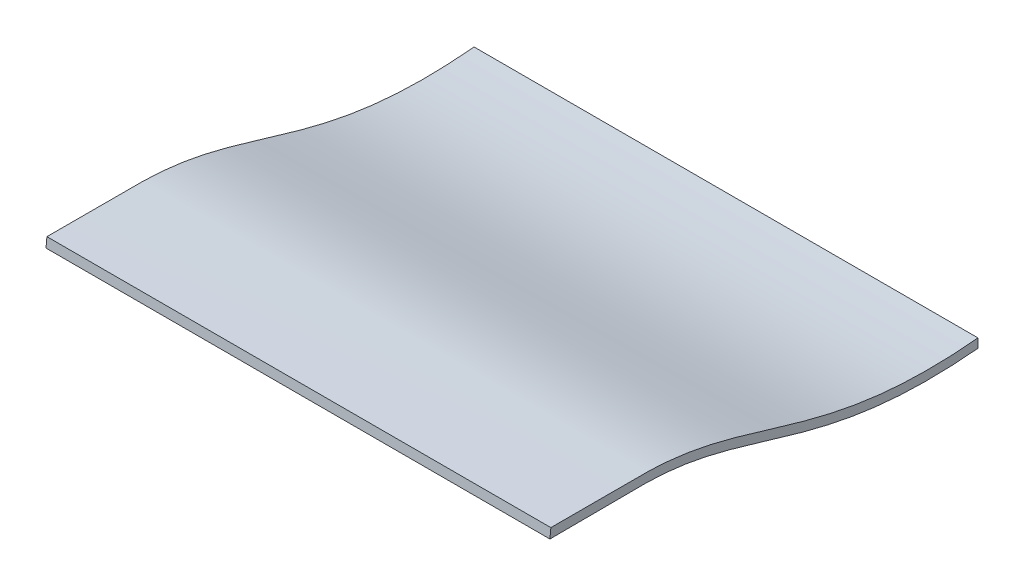
ISO-10303-21;
HEADER;
FILE_DESCRIPTION(('STEP AP214'),'2;1');
FILE_NAME('part.step','',(''),(''),'','','');
FILE_SCHEMA(('AUTOMOTIVE_DESIGN { 1 0 10303 214 1 1 1 1 }'));
ENDSEC;
DATA;
#1=APPLICATION_CONTEXT('core data for automotive mechanical design processes');
#2=APPLICATION_PROTOCOL_DEFINITION('international standard','automotive_design',2000,#1);
#3=PRODUCT_CONTEXT('',#1,'mechanical');
#4=PRODUCT('Part','Part','',(#3));
#5=PRODUCT_RELATED_PRODUCT_CATEGORY('part','',(#4));
#6=PRODUCT_DEFINITION_FORMATION('','',#4);
#7=PRODUCT_DEFINITION_CONTEXT('part definition',#1,'design');
#8=PRODUCT_DEFINITION('design','',#6,#7);
#9=PRODUCT_DEFINITION_SHAPE('','',#8);
#10=(LENGTH_UNIT() NAMED_UNIT(*) SI_UNIT(.MILLI.,.METRE.));
#11=(NAMED_UNIT(*) PLANE_ANGLE_UNIT() SI_UNIT($,.RADIAN.));
#12=(NAMED_UNIT(*) SI_UNIT($,.STERADIAN.) SOLID_ANGLE_UNIT());
#13=UNCERTAINTY_MEASURE_WITH_UNIT(LENGTH_MEASURE(1.E-05),#10,'distance_accuracy_value','');
#14=(GEOMETRIC_REPRESENTATION_CONTEXT(3) GLOBAL_UNCERTAINTY_ASSIGNED_CONTEXT((#13)) GLOBAL_UNIT_ASSIGNED_CONTEXT((#10,
#11,#12)) REPRESENTATION_CONTEXT('',''));
#15=CARTESIAN_POINT('',(0.,0.,0.));
#16=DIRECTION('',(0.,0.,1.));
#17=DIRECTION('',(1.,0.,0.));
#18=AXIS2_PLACEMENT_3D('',#15,#16,#17);
#19=CARTESIAN_POINT('',(2.8672,0.,4.));
#20=CARTESIAN_POINT('',(-3.92,0.,4.));
#21=CARTESIAN_POINT('',(2.8672,-0.024628468,4.256388466));
#22=CARTESIAN_POINT('',(-3.92,-0.024628468,4.256388466));
#23=CARTESIAN_POINT('',(2.8672,-0.038618016,4.72259081));
#24=CARTESIAN_POINT('',(-3.92,-0.038618016,4.72259081));
#25=CARTESIAN_POINT('',(2.8672,0.01947153,5.312011185));
#26=CARTESIAN_POINT('',(-3.92,0.01947153,5.312011185));
#27=CARTESIAN_POINT('',(2.8672,0.129906645,5.821389043));
#28=CARTESIAN_POINT('',(-3.92,0.129906645,5.821389043));
#29=CARTESIAN_POINT('',(2.8672,0.291873769,6.368027096));
#30=CARTESIAN_POINT('',(-3.92,0.291873769,6.368027096));
#31=CARTESIAN_POINT('',(2.8672,0.477782991,6.965975593));
#32=CARTESIAN_POINT('',(-3.92,0.477782991,6.965975593));
#33=CARTESIAN_POINT('',(2.8672,0.547843022,7.463268805));
#34=CARTESIAN_POINT('',(-3.92,0.547843022,7.463268805));
#35=CARTESIAN_POINT('',(2.8672,0.547843022,7.742133946));
#36=CARTESIAN_POINT('',(-3.92,0.547843022,7.742133946));
#37=CARTESIAN_POINT('',(2.8672,0.547843022,8.57930318693468));
#38=CARTESIAN_POINT('',(-3.92,0.547843022,8.57930318693468));
#39=CARTESIAN_POINT('',(2.8672,0.547843022,9.41647242786936));
#40=CARTESIAN_POINT('',(-3.92,0.547843022,9.41647242786936));
#41=CARTESIAN_POINT('',(2.8672,0.547843022,10.253641668804));
#42=CARTESIAN_POINT('',(-3.92,0.547843022,10.253641668804));
#43=B_SPLINE_SURFACE_WITH_KNOTS('',3,1,((#19,#20),(#21,#22),(#23,#24),(#25,#26),(#27,#28),(#29,
#30),(#31,#32),(#33,#34),(#35,#36),(#37,#38),(#39,#40),(#41,#42)),.UNSPECIFIED.,.F.,.F.,.F.,(4,
1,1,1,1,1,3,4),(2,2),(0.,0.14,0.28,0.42,0.559999999997895,0.780000000000162,1.,
1.66045269173853),(-0.00672,0.672),.UNSPECIFIED.);
#44=CARTESIAN_POINT('',(-2.8,0.547843022,8.74673703512159));
#45=CARTESIAN_POINT('',(-2.8,0.547842906702326,8.68528571674755));
#46=CARTESIAN_POINT('',(-2.8,0.547842964198973,8.62383439827284));
#47=CARTESIAN_POINT('',(-2.8,0.547843080107016,8.50060644710681));
#48=CARTESIAN_POINT('',(-2.8,0.547843138521643,8.43882981441547));
#49=CARTESIAN_POINT('',(-2.8,0.547842905081755,8.31506628140649));
#50=CARTESIAN_POINT('',(-2.8,0.54784261203436,8.25307938108954));
#51=CARTESIAN_POINT('',(-2.8,0.54784343259541,8.12901035819153));
#52=CARTESIAN_POINT('',(-2.8,0.547844548365387,8.06692823560921));
#53=CARTESIAN_POINT('',(-2.8,0.54784228226672,7.97475881607305));
#54=CARTESIAN_POINT('',(-2.8,0.547840921966892,7.94467151794153));
#55=CARTESIAN_POINT('',(-2.8,0.547845122145863,7.88449530220247));
#56=CARTESIAN_POINT('',(-2.8,0.547850682996255,7.85440638459473));
#57=CARTESIAN_POINT('',(-2.8,0.547839196398691,7.80929225221311));
#58=CARTESIAN_POINT('',(-2.8,0.547832073781566,7.79426703165736));
#59=CARTESIAN_POINT('',(-2.8,0.547853970254236,7.76421652035728));
#60=CARTESIAN_POINT('',(-2.8,0.547882989462217,7.74919122961287));
#61=CARTESIAN_POINT('',(-2.8,0.547783984428342,7.71914228667047));
#62=CARTESIAN_POINT('',(-2.8,0.547655976451005,7.70411863446392));
#63=CARTESIAN_POINT('',(-2.8,0.547182678089916,7.67407502080611));
#64=CARTESIAN_POINT('',(-2.8,0.546837390533576,7.65905505930935));
#65=CARTESIAN_POINT('',(-2.8,0.545498104294444,7.61408616045096));
#66=CARTESIAN_POINT('',(-2.8,0.544200462391214,7.58414561436942));
#67=CARTESIAN_POINT('',(-2.8,0.540781918126866,7.5243089237964));
#68=CARTESIAN_POINT('',(-2.8,0.538660916387852,7.49441278510221));
#69=CARTESIAN_POINT('',(-2.8,0.531084497477442,7.40491049720686));
#70=CARTESIAN_POINT('',(-2.8,0.524413060488041,7.3454037577374));
#71=CARTESIAN_POINT('',(-2.8,0.505054373277433,7.20553805547719));
#72=CARTESIAN_POINT('',(-2.8,0.49106741739192,7.12535976173874));
#73=CARTESIAN_POINT('',(-2.8,0.458348257888318,6.96576026035285));
#74=CARTESIAN_POINT('',(-2.8,0.439602277869368,6.88634195742287));
#75=CARTESIAN_POINT('',(-2.8,0.398804162548757,6.72826779878592));
#76=CARTESIAN_POINT('',(-2.8,0.376747614363769,6.6496131122451));
#77=CARTESIAN_POINT('',(-2.8,0.330896653138866,6.49237475511494));
#78=CARTESIAN_POINT('',(-2.8,0.307093689085984,6.41379364626243));
#79=CARTESIAN_POINT('',(-2.8,0.259573871282777,6.25673118750272));
#80=CARTESIAN_POINT('',(-2.8,0.235856942343488,6.17824986110475));
#81=CARTESIAN_POINT('',(-2.8,0.189972865135392,6.02085254458342));
#82=CARTESIAN_POINT('',(-2.8,0.167805232549242,5.94193669869016));
#83=CARTESIAN_POINT('',(-2.8,0.126099769165425,5.78297462889497));
#84=CARTESIAN_POINT('',(-2.8,0.106575783383594,5.70292470923044));
#85=CARTESIAN_POINT('',(-2.8,0.0711327721986367,5.54198267820483));
#86=CARTESIAN_POINT('',(-2.8,0.0552153901064553,5.46109020042868));
#87=CARTESIAN_POINT('',(-2.8,0.0274831509551212,5.29860395630055));
#88=CARTESIAN_POINT('',(-2.8,0.0156681085146804,5.21701022180858));
#89=CARTESIAN_POINT('',(-2.8,-0.00365394145678587,5.05365115991832));
#90=CARTESIAN_POINT('',(-2.8,-0.0111783002128884,4.97188788512288));
#91=CARTESIAN_POINT('',(-2.8,-0.0220647987660413,4.80807822579403));
#92=CARTESIAN_POINT('',(-2.8,-0.0254264454305133,4.72603180887268));
#93=CARTESIAN_POINT('',(-2.8,-0.0282081796048502,4.56189899319011));
#94=CARTESIAN_POINT('',(-2.8,-0.0276293976794587,4.47981261265323));
#95=CARTESIAN_POINT('',(-2.8,-0.0232940887268819,4.33140886200852));
#96=CARTESIAN_POINT('',(-2.8,-0.0201650529801226,4.26507158041845));
#97=CARTESIAN_POINT('',(-2.8,-0.0116978988822259,4.13245532577286));
#98=CARTESIAN_POINT('',(-2.8,-0.00635707039965284,4.06617652456653));
#99=CARTESIAN_POINT('',(-2.8,0.,4.));
#100=B_SPLINE_CURVE_WITH_KNOTS('',3,(#44,#45,#46,#47,#48,#49,#50,#51,#52,#53,#54,#55,#56,#57,
#58,#59,#60,#61,#62,#63,#64,#65,#66,#67,#68,#69,#70,#71,#72,#73,#74,#75,#76,#77,#78,#79,#80,#81,
#82,#83,#84,#85,#86,#87,#88,#89,#90,#91,#92,#93,#94,#95,#96,#97,#98,#99),.UNSPECIFIED.,.F.,.F.,
(4,2,2,2,2,2,2,2,2,2,2,2,2,2,2,2,2,2,2,2,2,2,2,2,2,2,2,4),(0.,0.184353955323629,
0.369683853295539,0.555644554758549,0.741890920555486,0.832152817327458,0.922419560432007,
0.967495234547427,1.01257105606386,1.05764220912332,1.10271277569349,1.19260620618809,
1.28251049001648,1.46205914291478,1.70604383123385,1.95074302330179,2.19577133701712,
2.44209177025096,2.68804945864641,2.93392991238468,3.18105199234312,3.42828644545333,
3.67550972479147,3.92172602834634,4.16797149694215,4.4141463172052,4.61334321924149,
4.81278492478183),.UNSPECIFIED.);
#101=CARTESIAN_POINT('',(-2.8,0.547843022,8.7467370351216));
#102=VERTEX_POINT('',#101);
#103=CARTESIAN_POINT('',(-2.8,0.,4.));
#104=VERTEX_POINT('',#103);
#105=EDGE_CURVE('E23',#102,#104,#100,.T.);
#106=DIRECTION('',(1.,0.,0.));
#107=VECTOR('',#106,1.);
#108=CARTESIAN_POINT('',(0.,0.547843022,8.74673703512162));
#109=LINE('',#108,#107);
#110=CARTESIAN_POINT('',(2.8,0.547843022,8.7467370351216));
#111=VERTEX_POINT('',#110);
#112=EDGE_CURVE('E65',#111,#102,#109,.F.);
#113=CARTESIAN_POINT('',(2.8,0.,4.));
#114=CARTESIAN_POINT('',(2.8,-0.00884743046204992,4.09205858219701));
#115=CARTESIAN_POINT('',(2.8,-0.0157227959919003,4.18433034520398));
#116=CARTESIAN_POINT('',(2.8,-0.0250705776314633,4.36921030327923));
#117=CARTESIAN_POINT('',(2.8,-0.0275374015249569,4.46181877654538));
#118=CARTESIAN_POINT('',(2.8,-0.0275844910846493,4.64707318642334));
#119=CARTESIAN_POINT('',(2.8,-0.0251634165216857,4.73971912634436));
#120=CARTESIAN_POINT('',(2.8,-0.0151702693742893,4.92285018551999));
#121=CARTESIAN_POINT('',(2.8,-0.00770377228910637,5.01334098714492));
#122=CARTESIAN_POINT('',(2.8,0.0124057404538056,5.19368091528302));
#123=CARTESIAN_POINT('',(2.8,0.0250450581813154,5.28353045363163));
#124=CARTESIAN_POINT('',(2.8,0.055295524818302,5.46228799230291));
#125=CARTESIAN_POINT('',(2.8,0.0729015629968635,5.55119686350463));
#126=CARTESIAN_POINT('',(2.8,0.106902452484785,5.70333505026525));
#127=CARTESIAN_POINT('',(2.8,0.122261992695236,5.76680053179104));
#128=CARTESIAN_POINT('',(2.8,0.154795780809255,5.89326590331332));
#129=CARTESIAN_POINT('',(2.8,0.17197015648176,5.95626576019416));
#130=CARTESIAN_POINT('',(2.8,0.207609416509552,6.0820341866934));
#131=CARTESIAN_POINT('',(2.8,0.226076861143274,6.14480202266021));
#132=CARTESIAN_POINT('',(2.8,0.263576065434319,6.2701696677427));
#133=CARTESIAN_POINT('',(2.8,0.282607881064201,6.33276945951636));
#134=CARTESIAN_POINT('',(2.8,0.339342837832746,6.52067130538712));
#135=CARTESIAN_POINT('',(2.8,0.376693554934573,6.64610182510756));
#136=CARTESIAN_POINT('',(2.8,0.426789565151415,6.83559559014639));
#137=CARTESIAN_POINT('',(2.8,0.44247493218745,6.89885962548878));
#138=CARTESIAN_POINT('',(2.8,0.471129988229087,7.02599107732407));
#139=CARTESIAN_POINT('',(2.8,0.484100341283253,7.08985834227338));
#140=CARTESIAN_POINT('',(2.8,0.506767336079929,7.21851795518392));
#141=CARTESIAN_POINT('',(2.8,0.516447085169036,7.28331334847186));
#142=CARTESIAN_POINT('',(2.8,0.528146294018996,7.38088824719804));
#143=CARTESIAN_POINT('',(2.8,0.531577558503533,7.41350283404392));
#144=CARTESIAN_POINT('',(2.8,0.537472390646986,7.47881643158059));
#145=CARTESIAN_POINT('',(2.8,0.539936073128194,7.51151543179027));
#146=CARTESIAN_POINT('',(2.8,0.543880754246365,7.57707670126507));
#147=CARTESIAN_POINT('',(2.8,0.545358615569614,7.60993915961647));
#148=CARTESIAN_POINT('',(2.8,0.54685117899047,7.6592557233188));
#149=CARTESIAN_POINT('',(2.8,0.547227996356305,7.67569950172081));
#150=CARTESIAN_POINT('',(2.8,0.547705404736432,7.70859144176619));
#151=CARTESIAN_POINT('',(2.8,0.547805987776157,7.72503960352237));
#152=CARTESIAN_POINT('',(2.8,0.547880023412574,7.75797686300814));
#153=CARTESIAN_POINT('',(2.8,0.547853156827478,7.77446596004081));
#154=CARTESIAN_POINT('',(2.8,0.547832887290195,7.80744403579182));
#155=CARTESIAN_POINT('',(2.8,0.547839483949478,7.82393301450929));
#156=CARTESIAN_POINT('',(2.8,0.547850097794964,7.87339850412885));
#157=CARTESIAN_POINT('',(2.8,0.547844940213279,7.90637499497928));
#158=CARTESIAN_POINT('',(2.8,0.547841054617476,7.97317327197277));
#159=CARTESIAN_POINT('',(2.8,0.547842494800152,8.00699505848345));
#160=CARTESIAN_POINT('',(2.8,0.547843549206849,8.07463907667339));
#161=CARTESIAN_POINT('',(2.8,0.547843163406621,8.1084613083526));
#162=CARTESIAN_POINT('',(2.8,0.547842880860223,8.17604194794232));
#163=CARTESIAN_POINT('',(2.8,0.54784298319255,8.20980035585081));
#164=CARTESIAN_POINT('',(2.8,0.547843060807309,8.27731704928939));
#165=CARTESIAN_POINT('',(2.8,0.547843036090201,8.31107533481947));
#166=CARTESIAN_POINT('',(2.8,0.547842993944022,8.41205208752087));
#167=CARTESIAN_POINT('',(2.8,0.547843008021134,8.47927055476103));
#168=CARTESIAN_POINT('',(2.8,0.547843035881305,8.61323835973819));
#169=CARTESIAN_POINT('',(2.8,0.54784304966573,8.67998769747519));
#170=CARTESIAN_POINT('',(2.8,0.547843022,8.74673703512159));
#171=B_SPLINE_CURVE_WITH_KNOTS('',3,(#113,#114,#115,#116,#117,#118,#119,#120,#121,#122,#123,
#124,#125,#126,#127,#128,#129,#130,#131,#132,#133,#134,#135,#136,#137,#138,#139,#140,#141,#142,
#143,#144,#145,#146,#147,#148,#149,#150,#151,#152,#153,#154,#155,#156,#157,#158,#159,#160,#161,
#162,#163,#164,#165,#166,#167,#168,#169,#170),.UNSPECIFIED.,.F.,.F.,(4,2,2,2,2,2,2,2,2,2,2,2,2,
2,2,2,2,2,2,2,2,2,2,2,2,2,2,2,4),(0.,0.277462266606104,0.5552762437618,0.833166406002992,
1.10541473416526,1.37746877728997,1.64924389290612,1.84510669939396,2.04098330430982,
2.23725935523744,2.43355493774901,2.82606442173887,3.02155488316188,3.21699747476353,
3.41342875254236,3.51180035622406,3.61016028268545,3.70883175873313,3.7581741608985,
3.80751798750718,3.85698545475782,3.9064523476588,4.0053818540261,4.10684720411547,
4.20831390168262,4.30958912473716,4.41086398148947,4.61251938311767,4.81276739623828),.UNSPECIFIED.);
#172=CARTESIAN_POINT('',(2.8,0.,4.));
#173=VERTEX_POINT('',#172);
#174=EDGE_CURVE('E78',#173,#111,#171,.T.);
#175=DIRECTION('',(1.,0.,0.));
#176=VECTOR('',#175,1.);
#177=CARTESIAN_POINT('',(0.,0.,4.));
#178=LINE('',#177,#176);
#179=EDGE_CURVE('E67',#173,#104,#178,.F.);
#180=ORIENTED_EDGE('',*,*,#105,.F.);
#181=ORIENTED_EDGE('',*,*,#112,.F.);
#182=ORIENTED_EDGE('',*,*,#174,.F.);
#183=ORIENTED_EDGE('',*,*,#179,.T.);
#184=EDGE_LOOP('',(#180,#181,#182,#183));
#185=FACE_BOUND('',#184,.T.);
#186=ADVANCED_FACE('F16',(#185),#43,.F.);
#187=CARTESIAN_POINT('',(-2.8,0.192627967,4.));
#188=DIRECTION('',(-1.,0.,0.));
#189=DIRECTION('',(0.,0.,1.));
#190=AXIS2_PLACEMENT_3D('',#187,#188,#189);
#191=PLANE('',#190);
#192=DIRECTION('',(0.,-0.995418002222509,0.095619040213487));
#193=VECTOR('',#192,1.);
#194=CARTESIAN_POINT('',(-2.8,0.543920262213487,8.74711385222251));
#195=LINE('',#194,#193);
#196=CARTESIAN_POINT('',(-2.8,0.442668977260629,8.75683996795073));
#197=VERTEX_POINT('',#196);
#198=EDGE_CURVE('E72',#102,#197,#195,.T.);
#199=ORIENTED_EDGE('',*,*,#198,.F.);
#200=ORIENTED_EDGE('',*,*,#105,.T.);
#201=DIRECTION('',(0.,1.,0.));
#202=VECTOR('',#201,1.);
#203=CARTESIAN_POINT('',(-2.8,-0.1,4.));
#204=LINE('',#203,#202);
#205=CARTESIAN_POINT('',(-2.8,-0.1,4.));
#206=VERTEX_POINT('',#205);
#207=EDGE_CURVE('E86',#104,#206,#204,.F.);
#208=ORIENTED_EDGE('',*,*,#207,.T.);
#209=CARTESIAN_POINT('',(-2.8,-0.1,4.));
#210=CARTESIAN_POINT('',(-2.8,-0.108905872787101,4.09474520944262));
#211=CARTESIAN_POINT('',(-2.8,-0.115789153962948,4.1897074515527));
#212=CARTESIAN_POINT('',(-2.8,-0.124989931256523,4.37995403207937));
#213=CARTESIAN_POINT('',(-2.8,-0.127302369388049,4.47523861056854));
#214=CARTESIAN_POINT('',(-2.8,-0.126818780818783,4.66582542472838));
#215=CARTESIAN_POINT('',(-2.8,-0.12402178582099,4.7611276603228));
#216=CARTESIAN_POINT('',(-2.8,-0.113048144902698,4.94950631638367));
#217=CARTESIAN_POINT('',(-2.8,-0.104980517394534,5.04258904340113));
#218=CARTESIAN_POINT('',(-2.8,-0.0834777878587851,5.22807357373039));
#219=CARTESIAN_POINT('',(-2.8,-0.0700463112012425,5.32047579411537));
#220=CARTESIAN_POINT('',(-2.8,-0.0460659967579736,5.45835332332887));
#221=CARTESIAN_POINT('',(-2.8,-0.0374381554607821,5.5041723570409));
#222=CARTESIAN_POINT('',(-2.8,-0.0189857232088821,5.59556286418674));
#223=CARTESIAN_POINT('',(-2.8,-0.00916129651699088,5.64113437070498));
#224=CARTESIAN_POINT('',(-2.8,0.0155671182570966,5.74947932695414));
#225=CARTESIAN_POINT('',(-2.8,0.0309729127038378,5.81213799274748));
#226=CARTESIAN_POINT('',(-2.8,0.0634872313896632,5.93701426318799));
#227=CARTESIAN_POINT('',(-2.8,0.0805959248745248,5.99923182333544));
#228=CARTESIAN_POINT('',(-2.8,0.133701177283009,6.18543382773715));
#229=CARTESIAN_POINT('',(-2.8,0.171461549029286,6.30890481440444));
#230=CARTESIAN_POINT('',(-2.8,0.227310585281221,6.49434791357856));
#231=CARTESIAN_POINT('',(-2.8,0.245796046913832,6.55620526739254));
#232=CARTESIAN_POINT('',(-2.8,0.281686067422485,6.68022985177974));
#233=CARTESIAN_POINT('',(-2.8,0.299090780495993,6.74239703677372));
#234=CARTESIAN_POINT('',(-2.8,0.331921619369486,6.86699277584998));
#235=CARTESIAN_POINT('',(-2.8,0.347355388066259,6.929419286883));
#236=CARTESIAN_POINT('',(-2.8,0.375539412252017,7.05487328306878));
#237=CARTESIAN_POINT('',(-2.8,0.388290363935862,7.11790060786076));
#238=CARTESIAN_POINT('',(-2.8,0.404923055608675,7.21310745048152));
#239=CARTESIAN_POINT('',(-2.8,0.410065411026173,7.24506855513573));
#240=CARTESIAN_POINT('',(-2.8,0.419429875752844,7.30912827829778));
#241=CARTESIAN_POINT('',(-2.8,0.423651930908881,7.34122690478454));
#242=CARTESIAN_POINT('',(-2.8,0.431130256220014,7.40558404973198));
#243=CARTESIAN_POINT('',(-2.8,0.434385107610895,7.43784273319446));
#244=CARTESIAN_POINT('',(-2.8,0.439889206173268,7.50244171907489));
#245=CARTESIAN_POINT('',(-2.8,0.442138605108399,7.5347820084336));
#246=CARTESIAN_POINT('',(-2.8,0.444751922462403,7.58338740533369));
#247=CARTESIAN_POINT('',(-2.8,0.445496849948542,7.59963287809563));
#248=CARTESIAN_POINT('',(-2.8,0.446730992637988,7.6321329865827));
#249=CARTESIAN_POINT('',(-2.8,0.447220218773499,7.64838762188634));
#250=CARTESIAN_POINT('',(-2.8,0.447941961489845,7.68090518168157));
#251=CARTESIAN_POINT('',(-2.8,0.448174436850442,7.69716810708491));
#252=CARTESIAN_POINT('',(-2.8,0.448337242978448,7.7215639524491));
#253=CARTESIAN_POINT('',(-2.8,0.448360525648154,7.72969632518401));
#254=CARTESIAN_POINT('',(-2.8,0.448336315686042,7.74596101646417));
#255=CARTESIAN_POINT('',(-2.8,0.448288822166695,7.75409333500745));
#256=CARTESIAN_POINT('',(-2.8,0.448148783420142,7.77853033934389));
#257=CARTESIAN_POINT('',(-2.8,0.448058927320061,7.79483498451979));
#258=CARTESIAN_POINT('',(-2.8,0.447877341397791,7.82744397730012));
#259=CARTESIAN_POINT('',(-2.8,0.44778561161309,7.84374832490398));
#260=CARTESIAN_POINT('',(-2.8,0.447510947642803,7.89265936329145));
#261=CARTESIAN_POINT('',(-2.8,0.447328527544684,7.92526604631015));
#262=CARTESIAN_POINT('',(-2.8,0.446958450186208,7.99134991848952));
#263=CARTESIAN_POINT('',(-2.8,0.446770783125569,8.02482710779822));
#264=CARTESIAN_POINT('',(-2.8,0.44639554540241,8.09178213059635));
#265=CARTESIAN_POINT('',(-2.8,0.44620797474182,8.12525996408576));
#266=CARTESIAN_POINT('',(-2.8,0.445645979505342,8.2255606697448));
#267=CARTESIAN_POINT('',(-2.8,0.445271527753725,8.29238354232488));
#268=CARTESIAN_POINT('',(-2.8,0.444524370254195,8.42572094308319));
#269=CARTESIAN_POINT('',(-2.8,0.444151664422522,8.49223547126267));
#270=CARTESIAN_POINT('',(-2.8,0.443408967767523,8.6247799889004));
#271=CARTESIAN_POINT('',(-2.8,0.443038976944517,8.69080997835864));
#272=CARTESIAN_POINT('',(-2.8,0.442668977260629,8.75683996795071));
#273=B_SPLINE_CURVE_WITH_KNOTS('',3,(#209,#210,#211,#212,#213,#214,#215,#216,#217,#218,#219,
#220,#221,#222,#223,#224,#225,#226,#227,#228,#229,#230,#231,#232,#233,#234,#235,#236,#237,#238,
#239,#240,#241,#242,#243,#244,#245,#246,#247,#248,#249,#250,#251,#252,#253,#254,#255,#256,#257,
#258,#259,#260,#261,#262,#263,#264,#265,#266,#267,#268,#269,#270,#271,#272),.UNSPECIFIED.,.F.,
.F.,(4,2,2,2,2,2,2,2,2,2,2,2,2,2,2,2,2,2,2,2,2,2,2,2,2,2,2,2,2,2,2,4),(0.,0.285506980144167,
0.571329719045214,0.85720663029884,1.13735004307945,1.41730442942976,1.55716367382693,
1.69700374045805,1.89054662021298,2.08410875482945,2.47142674369267,2.66510793330223,
2.85876142535276,3.05163956399039,3.24446758857313,3.34157265237801,3.43868342858493,
3.53593595856488,3.63317380422444,3.68195977354655,3.73074365691247,3.77953537118399,
3.80393231666072,3.82832956807602,3.87724433973849,3.92615813368494,4.02397973151109,
4.12441287247664,4.22484795054686,4.42531971476556,4.62486643208221,4.82295951041181),.UNSPECIFIED.);
#274=EDGE_CURVE('E82',#206,#197,#273,.T.);
#275=ORIENTED_EDGE('',*,*,#274,.T.);
#276=EDGE_LOOP('',(#199,#200,#208,#275));
#277=FACE_BOUND('',#276,.T.);
#278=ADVANCED_FACE('F81',(#277),#191,.T.);
#279=CARTESIAN_POINT('',(0.,0.543920262213487,8.74711385222251));
#280=DIRECTION('',(0.,0.095619040213487,0.995418002222509));
#281=DIRECTION('',(0.,-0.995418002222509,0.095619040213487));
#282=AXIS2_PLACEMENT_3D('',#279,#280,#281);
#283=PLANE('',#282);
#284=DIRECTION('',(0.,-0.995418002222516,0.0956190402134144));
#285=VECTOR('',#284,1.);
#286=CARTESIAN_POINT('',(2.8,0.547843022,8.74673703512162));
#287=LINE('',#286,#285);
#288=CARTESIAN_POINT('',(2.8,0.442668977260628,8.75683996795072));
#289=VERTEX_POINT('',#288);
#290=EDGE_CURVE('E77',#111,#289,#287,.T.);
#291=ORIENTED_EDGE('',*,*,#290,.F.);
#292=ORIENTED_EDGE('',*,*,#112,.T.);
#293=ORIENTED_EDGE('',*,*,#198,.T.);
#294=DIRECTION('',(1.,0.,0.));
#295=VECTOR('',#294,1.);
#296=CARTESIAN_POINT('',(0.5264,0.442668977260628,8.75683996795073));
#297=LINE('',#296,#295);
#298=EDGE_CURVE('E96',#197,#289,#297,.T.);
#299=ORIENTED_EDGE('',*,*,#298,.T.);
#300=EDGE_LOOP('',(#291,#292,#293,#299));
#301=FACE_BOUND('',#300,.T.);
#302=ADVANCED_FACE('F74',(#301),#283,.T.);
#303=CARTESIAN_POINT('',(2.8,0.192627967,4.));
#304=DIRECTION('',(1.,0.,0.));
#305=DIRECTION('',(0.,0.,-1.));
#306=AXIS2_PLACEMENT_3D('',#303,#304,#305);
#307=PLANE('',#306);
#308=ORIENTED_EDGE('',*,*,#290,.T.);
#309=CARTESIAN_POINT('',(2.8,0.442668977260628,8.75683996795071));
#310=CARTESIAN_POINT('',(2.8,0.443022769517232,8.69370434357405));
#311=CARTESIAN_POINT('',(2.8,0.443376536561082,8.63056871826974));
#312=CARTESIAN_POINT('',(2.8,0.444086461082776,8.50387083457539));
#313=CARTESIAN_POINT('',(2.8,0.444442618559852,8.44030857618531));
#314=CARTESIAN_POINT('',(2.8,0.44515652455737,8.31290927456473));
#315=CARTESIAN_POINT('',(2.8,0.445514273299738,8.24907223134241));
#316=CARTESIAN_POINT('',(2.8,0.446230253443424,8.12127519693405));
#317=CARTESIAN_POINT('',(2.8,0.446588484447419,8.0573152057334));
#318=CARTESIAN_POINT('',(2.8,0.447121825118356,7.9621933600159));
#319=CARTESIAN_POINT('',(2.8,0.447296639243029,7.93103149462533));
#320=CARTESIAN_POINT('',(2.8,0.447645259326617,7.86870518392382));
#321=CARTESIAN_POINT('',(2.8,0.447819065202119,7.83754073860981));
#322=CARTESIAN_POINT('',(2.8,0.44808254321719,7.79082260818634));
#323=CARTESIAN_POINT('',(2.8,0.448170748807619,7.77526886911899));
#324=CARTESIAN_POINT('',(2.8,0.448299055500652,7.75193826387571));
#325=CARTESIAN_POINT('',(2.8,0.44834115706138,7.74416147130148));
#326=CARTESIAN_POINT('',(2.8,0.448358491692599,7.72860785372105));
#327=CARTESIAN_POINT('',(2.8,0.448333725180821,7.72083102871535));
#328=CARTESIAN_POINT('',(2.8,0.448067481552221,7.68195299172935));
#329=CARTESIAN_POINT('',(2.8,0.447398820087371,7.65085331131764));
#330=CARTESIAN_POINT('',(2.8,0.445123291729685,7.58879570346055));
#331=CARTESIAN_POINT('',(2.8,0.443519651188001,7.55783765572052));
#332=CARTESIAN_POINT('',(2.8,0.439385421633136,7.49597814202826));
#333=CARTESIAN_POINT('',(2.8,0.436854672647036,7.46507668676645));
#334=CARTESIAN_POINT('',(2.8,0.430887109568496,7.40341633343199));
#335=CARTESIAN_POINT('',(2.8,0.427451897306951,7.37265728020427));
#336=CARTESIAN_POINT('',(2.8,0.419709352397858,7.31125228708801));
#337=CARTESIAN_POINT('',(2.8,0.415402076940872,7.28060633991603));
#338=CARTESIAN_POINT('',(2.8,0.396708716919685,7.15958367161176));
#339=CARTESIAN_POINT('',(2.8,0.379096020441463,7.06969563599302));
#340=CARTESIAN_POINT('',(2.8,0.338426736591256,6.8908343766821));
#341=CARTESIAN_POINT('',(2.8,0.315348114394206,6.80186641814778));
#342=CARTESIAN_POINT('',(2.8,0.266094908978391,6.62460553267331));
#343=CARTESIAN_POINT('',(2.8,0.239913606522974,6.53631452847198));
#344=CARTESIAN_POINT('',(2.8,0.186835136998944,6.35985117835199));
#345=CARTESIAN_POINT('',(2.8,0.159937224786757,6.27167906476384));
#346=CARTESIAN_POINT('',(2.8,0.107691834337165,6.09508049133885));
#347=CARTESIAN_POINT('',(2.8,0.0823409876022159,6.00665505754102));
#348=CARTESIAN_POINT('',(2.8,0.0349300159635712,5.82900916519259));
#349=CARTESIAN_POINT('',(2.8,0.0128663837243808,5.73978966320799));
#350=CARTESIAN_POINT('',(2.8,-0.0267092241829617,5.56103265157469));
#351=CARTESIAN_POINT('',(2.8,-0.0442539938218682,5.47150250546405));
#352=CARTESIAN_POINT('',(2.8,-0.0744147480151722,5.29150039786817));
#353=CARTESIAN_POINT('',(2.8,-0.0870248657233746,5.20102744581747));
#354=CARTESIAN_POINT('',(2.8,-0.107118325517803,5.0194427374583));
#355=CARTESIAN_POINT('',(2.8,-0.11459763207439,4.92833053512748));
#356=CARTESIAN_POINT('',(2.8,-0.124621547131855,4.74402703690103));
#357=CARTESIAN_POINT('',(2.8,-0.127065406368606,4.65083032678837));
#358=CARTESIAN_POINT('',(2.8,-0.127089355072687,4.46448435489056));
#359=CARTESIAN_POINT('',(2.8,-0.12467136414611,4.37133508889788));
#360=CARTESIAN_POINT('',(2.8,-0.115475127303655,4.18538871156509));
#361=CARTESIAN_POINT('',(2.8,-0.108703443259553,4.09259128131295));
#362=CARTESIAN_POINT('',(2.8,-0.1,4.));
#363=B_SPLINE_CURVE_WITH_KNOTS('',3,(#309,#310,#311,#312,#313,#314,#315,#316,#317,#318,#319,
#320,#321,#322,#323,#324,#325,#326,#327,#328,#329,#330,#331,#332,#333,#334,#335,#336,#337,#338,
#339,#340,#341,#342,#343,#344,#345,#346,#347,#348,#349,#350,#351,#352,#353,#354,#355,#356,#357,
#358,#359,#360,#361,#362),.UNSPECIFIED.,.F.,.F.,(4,2,2,2,2,2,2,2,2,2,2,2,2,2,2,2,2,2,2,2,2,2,2,
2,2,2,4),(0.,0.189409848492533,0.380099616316693,0.571613757265871,0.763496725133452,
0.856983811131696,0.950478524159842,0.997140589932767,1.02047117113615,1.04380160659157,
1.13710661624903,1.23009154619799,1.32309252829543,1.41592989808098,1.50876118149295,
1.78328249290021,2.0589299084933,2.33518557327125,2.61174066181496,2.88767036800021,
3.1633035260105,3.43687612004138,3.71077298560985,3.9848850326536,4.26443026524678,
4.54386514656606,4.8228798487563),.UNSPECIFIED.);
#364=CARTESIAN_POINT('',(2.8,-0.1,4.));
#365=VERTEX_POINT('',#364);
#366=EDGE_CURVE('E34',#289,#365,#363,.T.);
#367=ORIENTED_EDGE('',*,*,#366,.T.);
#368=DIRECTION('',(0.,1.,0.));
#369=VECTOR('',#368,1.);
#370=CARTESIAN_POINT('',(2.8,-0.1,4.));
#371=LINE('',#370,#369);
#372=EDGE_CURVE('E42',#365,#173,#371,.T.);
#373=ORIENTED_EDGE('',*,*,#372,.T.);
#374=ORIENTED_EDGE('',*,*,#174,.T.);
#375=EDGE_LOOP('',(#308,#367,#373,#374));
#376=FACE_BOUND('',#375,.T.);
#377=ADVANCED_FACE('F101',(#376),#307,.T.);
#378=CARTESIAN_POINT('',(0.,-0.1,4.));
#379=DIRECTION('',(0.,0.,1.));
#380=DIRECTION('',(1.,0.,0.));
#381=AXIS2_PLACEMENT_3D('',#378,#379,#380);
#382=PLANE('',#381);
#383=ORIENTED_EDGE('',*,*,#207,.F.);
#384=ORIENTED_EDGE('',*,*,#179,.F.);
#385=ORIENTED_EDGE('',*,*,#372,.F.);
#386=DIRECTION('',(-1.,0.,0.));
#387=VECTOR('',#386,1.);
#388=CARTESIAN_POINT('',(0.5264,-0.1,4.));
#389=LINE('',#388,#387);
#390=EDGE_CURVE('E11',#365,#206,#389,.T.);
#391=ORIENTED_EDGE('',*,*,#390,.T.);
#392=EDGE_LOOP('',(#383,#384,#385,#391));
#393=FACE_BOUND('',#392,.T.);
#394=ADVANCED_FACE('F106',(#393),#382,.F.);
#395=CARTESIAN_POINT('',(-2.8672,-0.1,4.));
#396=CARTESIAN_POINT('',(3.92,-0.1,4.));
#397=CARTESIAN_POINT('',(-2.8672,-0.124487823,4.260512861));
#398=CARTESIAN_POINT('',(3.92,-0.124487823,4.260512861));
#399=CARTESIAN_POINT('',(-2.8672,-0.138196079,4.734963994));
#400=CARTESIAN_POINT('',(3.92,-0.138196079,4.734963994));
#401=CARTESIAN_POINT('',(-2.8672,-0.077568446,5.337055167));
#402=CARTESIAN_POINT('',(3.92,-0.077568446,5.337055167));
#403=CARTESIAN_POINT('',(-2.8672,0.035994262,5.856090972));
#404=CARTESIAN_POINT('',(3.92,0.035994262,5.856090972));
#405=CARTESIAN_POINT('',(-2.8672,0.200282397,6.407901627));
#406=CARTESIAN_POINT('',(3.92,0.200282397,6.407901627));
#407=CARTESIAN_POINT('',(-2.8672,0.382793216,6.999767267));
#408=CARTESIAN_POINT('',(3.92,0.382793216,6.999767267));
#409=CARTESIAN_POINT('',(-2.8672,0.449818564,7.4809073));
#410=CARTESIAN_POINT('',(3.92,0.449818564,7.4809073));
#411=CARTESIAN_POINT('',(-2.8672,0.448301222,7.75169585));
#412=CARTESIAN_POINT('',(3.92,0.448301222,7.75169585));
#413=CARTESIAN_POINT('',(-2.8672,0.44360768471719,8.58931594829228));
#414=CARTESIAN_POINT('',(3.92,0.44360768471719,8.58931594829228));
#415=CARTESIAN_POINT('',(-2.8672,0.438914147434381,9.42693604658455));
#416=CARTESIAN_POINT('',(3.92,0.438914147434381,9.42693604658455));
#417=CARTESIAN_POINT('',(-2.8672,0.434220610151571,10.2645561448768));
#418=CARTESIAN_POINT('',(3.92,0.434220610151571,10.2645561448768));
#419=B_SPLINE_SURFACE_WITH_KNOTS('',3,1,((#395,#396),(#397,#398),(#399,#400),(#401,#402),(#403,
#404),(#405,#406),(#407,#408),(#409,#410),(#411,#412),(#413,#414),(#415,#416),(#417,#418)),
.UNSPECIFIED.,.F.,.F.,.F.,(4,1,1,1,1,1,3,4),(2,2),(0.,0.14,0.28,0.42,0.559999999997895,
0.780000000000162,1.,1.68051777530537),(-0.00672,0.672),.UNSPECIFIED.);
#420=ORIENTED_EDGE('',*,*,#366,.F.);
#421=ORIENTED_EDGE('',*,*,#298,.F.);
#422=ORIENTED_EDGE('',*,*,#274,.F.);
#423=ORIENTED_EDGE('',*,*,#390,.F.);
#424=EDGE_LOOP('',(#420,#421,#422,#423));
#425=FACE_BOUND('',#424,.T.);
#426=ADVANCED_FACE('F18',(#425),#419,.F.);
#427=CLOSED_SHELL('',(#186,#278,#302,#377,#394,#426));
#428=MANIFOLD_SOLID_BREP('B1',#427);
#429=ADVANCED_BREP_SHAPE_REPRESENTATION('',(#18,#428),#14);
#430=SHAPE_DEFINITION_REPRESENTATION(#9,#429);
ENDSEC;
END-ISO-10303-21;
